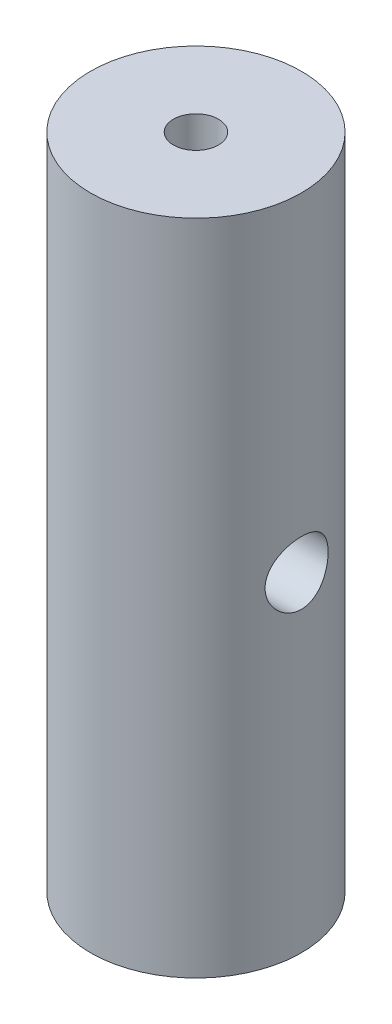
ISO-10303-21;
HEADER;
FILE_DESCRIPTION(('STEP AP214'),'2;1');
FILE_NAME('part.step','',(''),(''),'','','');
FILE_SCHEMA(('AUTOMOTIVE_DESIGN { 1 0 10303 214 1 1 1 1 }'));
ENDSEC;
DATA;
#1=APPLICATION_CONTEXT('core data for automotive mechanical design processes');
#2=APPLICATION_PROTOCOL_DEFINITION('international standard','automotive_design',2000,#1);
#3=PRODUCT_CONTEXT('',#1,'mechanical');
#4=PRODUCT('Part','Part','',(#3));
#5=PRODUCT_RELATED_PRODUCT_CATEGORY('part','',(#4));
#6=PRODUCT_DEFINITION_FORMATION('','',#4);
#7=PRODUCT_DEFINITION_CONTEXT('part definition',#1,'design');
#8=PRODUCT_DEFINITION('design','',#6,#7);
#9=PRODUCT_DEFINITION_SHAPE('','',#8);
#10=(LENGTH_UNIT() NAMED_UNIT(*) SI_UNIT(.MILLI.,.METRE.));
#11=(NAMED_UNIT(*) PLANE_ANGLE_UNIT() SI_UNIT($,.RADIAN.));
#12=(NAMED_UNIT(*) SI_UNIT($,.STERADIAN.) SOLID_ANGLE_UNIT());
#13=UNCERTAINTY_MEASURE_WITH_UNIT(LENGTH_MEASURE(1.E-05),#10,'distance_accuracy_value','');
#14=(GEOMETRIC_REPRESENTATION_CONTEXT(3) GLOBAL_UNCERTAINTY_ASSIGNED_CONTEXT((#13)) GLOBAL_UNIT_ASSIGNED_CONTEXT((#10,
#11,#12)) REPRESENTATION_CONTEXT('',''));
#15=CARTESIAN_POINT('',(0.,0.,0.));
#16=DIRECTION('',(0.,0.,1.));
#17=DIRECTION('',(1.,0.,0.));
#18=AXIS2_PLACEMENT_3D('',#15,#16,#17);
#19=CARTESIAN_POINT('',(0.,19.812,0.));
#20=DIRECTION('',(0.,-1.,0.));
#21=DIRECTION('',(0.,0.,-1.));
#22=AXIS2_PLACEMENT_3D('',#19,#20,#21);
#23=CYLINDRICAL_SURFACE('',#22,6.35);
#24=CARTESIAN_POINT('',(-6.05950725533851,0.,-1.89865));
#25=CARTESIAN_POINT('',(-6.05950836209902,-0.104056731084945,-1.8986486602891));
#26=CARTESIAN_POINT('',(-6.06221695254554,-0.20812672559677,-1.89006656275361));
#27=CARTESIAN_POINT('',(-6.07271572302677,-0.413225301729166,-1.85605262289029));
#28=CARTESIAN_POINT('',(-6.08050762689435,-0.514252839441015,-1.83061506456021));
#29=CARTESIAN_POINT('',(-6.10021334185413,-0.710267716434304,-1.76383019431639));
#30=CARTESIAN_POINT('',(-6.11212032811037,-0.805264750401846,-1.72250921229591));
#31=CARTESIAN_POINT('',(-6.13870536810647,-0.987001282200298,-1.62521684578365));
#32=CARTESIAN_POINT('',(-6.15338383058776,-1.07373955917544,-1.56924329983886));
#33=CARTESIAN_POINT('',(-6.18437543123224,-1.23922318381633,-1.442350823399));
#34=CARTESIAN_POINT('',(-6.20072321880337,-1.3176705434263,-1.37105165352194));
#35=CARTESIAN_POINT('',(-6.23291539727252,-1.46169206825804,-1.21634680114716));
#36=CARTESIAN_POINT('',(-6.248759723671,-1.52726458958394,-1.13293957502026));
#37=CARTESIAN_POINT('',(-6.27855311753239,-1.64496743410846,-0.954268086691941));
#38=CARTESIAN_POINT('',(-6.29245659931722,-1.69679416452574,-0.858795560945127));
#39=CARTESIAN_POINT('',(-6.31639934558556,-1.78354138284115,-0.660003889485409));
#40=CARTESIAN_POINT('',(-6.32643943753717,-1.81846549138823,-0.556686429697635));
#41=CARTESIAN_POINT('',(-6.34127899400443,-1.86943064283986,-0.34825498883519));
#42=CARTESIAN_POINT('',(-6.34621932545434,-1.88598027062312,-0.243275575871007));
#43=CARTESIAN_POINT('',(-6.35079868928174,-1.90133457696502,-0.0319216940235352));
#44=CARTESIAN_POINT('',(-6.3504388279676,-1.90014295865047,0.0744524791004591));
#45=CARTESIAN_POINT('',(-6.34455804021394,-1.88039050467709,0.28200920812676));
#46=CARTESIAN_POINT('',(-6.3392007582213,-1.86238038390201,0.383249540255709));
#47=CARTESIAN_POINT('',(-6.32412578388769,-1.81040145014144,0.58119894973728));
#48=CARTESIAN_POINT('',(-6.31440781612032,-1.7764316291148,0.67790774044585));
#49=CARTESIAN_POINT('',(-6.29147664295411,-1.6931231482956,0.865360995285923));
#50=CARTESIAN_POINT('',(-6.27822420569972,-1.64361080436898,0.956023273275862));
#51=CARTESIAN_POINT('',(-6.24963047038054,-1.53076001060854,1.12792903461921));
#52=CARTESIAN_POINT('',(-6.23428867970202,-1.46741829804835,1.20917028835806));
#53=CARTESIAN_POINT('',(-6.20246515386102,-1.32584846862672,1.36321447478767));
#54=CARTESIAN_POINT('',(-6.18596226363452,-1.24714309209676,1.43557501023548));
#55=CARTESIAN_POINT('',(-6.15419081446999,-1.07855363746694,1.56619480309855));
#56=CARTESIAN_POINT('',(-6.13892237660228,-0.988668465084916,1.62445267849385));
#57=CARTESIAN_POINT('',(-6.11124797523516,-0.799112673898009,1.72567072676681));
#58=CARTESIAN_POINT('',(-6.0988704872523,-0.699357451496821,1.76848081308384));
#59=CARTESIAN_POINT('',(-6.07871772039672,-0.493597626902782,1.83656363554426));
#60=CARTESIAN_POINT('',(-6.07094095204196,-0.387595059521354,1.86184204802071));
#61=CARTESIAN_POINT('',(-6.0611967498317,-0.176557719136448,1.89331907060701));
#62=CARTESIAN_POINT('',(-6.0590247902462,-0.0716325533841485,1.90018977282286));
#63=CARTESIAN_POINT('',(-6.06017075549361,0.137874285456838,1.89653240871972));
#64=CARTESIAN_POINT('',(-6.06348791795368,0.242456004224858,1.88600675854449));
#65=CARTESIAN_POINT('',(-6.07503772913528,0.445510781136036,1.84845383888855));
#66=CARTESIAN_POINT('',(-6.08314158629683,0.54407179567361,1.8218585265992));
#67=CARTESIAN_POINT('',(-6.1032184910947,0.735326194242806,1.75342161272866));
#68=CARTESIAN_POINT('',(-6.11519213339039,0.828018673852953,1.71157766780542));
#69=CARTESIAN_POINT('',(-6.14205682604908,1.00764071743193,1.61255368361553));
#70=CARTESIAN_POINT('',(-6.15701721855646,1.09435041082504,1.55499409715736));
#71=CARTESIAN_POINT('',(-6.18802036827941,1.25712578840839,1.42662408374765));
#72=CARTESIAN_POINT('',(-6.20406338223695,1.33318893454616,1.35581050652144));
#73=CARTESIAN_POINT('',(-6.23615132972717,1.47544712256741,1.1997844495878));
#74=CARTESIAN_POINT('',(-6.25217383048129,1.54116586941328,1.11413201460967));
#75=CARTESIAN_POINT('',(-6.28181001766366,1.65730851583797,0.932633457352187));
#76=CARTESIAN_POINT('',(-6.2954238242869,1.70773317868864,0.836787844099666));
#77=CARTESIAN_POINT('',(-6.31862529359599,1.79136991025286,0.638259815334184));
#78=CARTESIAN_POINT('',(-6.32824297220222,1.82471075873782,0.535635337960174));
#79=CARTESIAN_POINT('',(-6.34250107683316,1.87356479072753,0.325901228017517));
#80=CARTESIAN_POINT('',(-6.34714291652577,1.88908303783766,0.218792878336237));
#81=CARTESIAN_POINT('',(-6.35084087390088,1.90146836594257,0.00753454649049496));
#82=CARTESIAN_POINT('',(-6.35010393022823,1.89902640389055,-0.0965718108486248));
#83=CARTESIAN_POINT('',(-6.34361423906007,1.87721091003836,-0.302826535456635));
#84=CARTESIAN_POINT('',(-6.33786177271047,1.85783832728664,-0.404975012146831));
#85=CARTESIAN_POINT('',(-6.32204583525025,1.80313806615273,-0.603360373971998));
#86=CARTESIAN_POINT('',(-6.31202872896096,1.76798176905753,-0.699648463014059));
#87=CARTESIAN_POINT('',(-6.28871957901085,1.6828652584623,-0.885009886335531));
#88=CARTESIAN_POINT('',(-6.27542699926727,1.63290262140026,-0.974082036438965));
#89=CARTESIAN_POINT('',(-6.24643795947491,1.51774683028589,-1.14556553178506));
#90=CARTESIAN_POINT('',(-6.23067843411207,1.45211937566507,-1.22767448433797));
#91=CARTESIAN_POINT('',(-6.19873502651731,1.30828028025935,-1.37994531768062));
#92=CARTESIAN_POINT('',(-6.18255102354695,1.23006502578324,-1.45010375578932));
#93=CARTESIAN_POINT('',(-6.15102837350678,1.06049674556892,-1.57856319842188));
#94=CARTESIAN_POINT('',(-6.1357288343291,0.968823816704458,-1.63645259133346));
#95=CARTESIAN_POINT('',(-6.10833238034875,0.776605160437494,-1.73593009553797));
#96=CARTESIAN_POINT('',(-6.09623390901123,0.676063777194378,-1.77752613429883));
#97=CARTESIAN_POINT('',(-6.07782111879218,0.480322774737779,-1.83943365776697));
#98=CARTESIAN_POINT('',(-6.07101802449385,0.385746276493829,-1.8615788970489));
#99=CARTESIAN_POINT('',(-6.06186101519048,0.194116704322022,-1.89118624548325));
#100=CARTESIAN_POINT('',(-6.05950622295226,0.0970641225203689,-1.89865124968237));
#101=CARTESIAN_POINT('',(-6.05950725533851,0.,-1.89865));
#102=B_SPLINE_CURVE_WITH_KNOTS('',3,(#24,#25,#26,#27,#28,#29,#30,#31,#32,#33,#34,#35,#36,#37,
#38,#39,#40,#41,#42,#43,#44,#45,#46,#47,#48,#49,#50,#51,#52,#53,#54,#55,#56,#57,#58,#59,#60,#61,
#62,#63,#64,#65,#66,#67,#68,#69,#70,#71,#72,#73,#74,#75,#76,#77,#78,#79,#80,#81,#82,#83,#84,#85,
#86,#87,#88,#89,#90,#91,#92,#93,#94,#95,#96,#97,#98,#99,#100,#101),.UNSPECIFIED.,.T.,.F.,(4,2,2,
2,2,2,2,2,2,2,2,2,2,2,2,2,2,2,2,2,2,2,2,2,2,2,2,2,2,2,2,2,2,2,2,2,2,2,4),(0.,0.31181217424738,
0.623730143993152,0.935133262915574,1.24658234395571,1.56690137708128,1.88726128289037,
2.21419791722968,2.54106448863615,2.85863887687209,3.17614697879781,3.48360985368429,
3.79109215104744,4.10214074924878,4.41326281177627,4.73630164641618,5.05937212512478,
5.3855019374521,5.71152610745593,6.02547325771771,6.3393768081665,6.64519621263726,
6.95106263390641,7.26509343820971,7.57919897792713,7.90506889573818,8.23092254789494,
8.55428234135175,8.87755024183972,9.18844844313185,9.49932921809684,9.80691312636898,
10.1145474090622,10.4319770816063,10.749498044586,11.0764009966181,11.4031446971402,
11.694060480974,11.984918888392),.UNSPECIFIED.);
#103=CARTESIAN_POINT('',(-6.05950725533851,0.,-1.89865));
#104=VERTEX_POINT('',#103);
#105=EDGE_CURVE('E403',#104,#104,#102,.T.);
#106=ORIENTED_EDGE('',*,*,#105,.F.);
#107=EDGE_LOOP('',(#106));
#108=FACE_BOUND('',#107,.T.);
#109=CARTESIAN_POINT('',(0.,19.812,0.));
#110=DIRECTION('',(0.,1.,0.));
#111=DIRECTION('',(0.,0.,1.));
#112=AXIS2_PLACEMENT_3D('',#109,#110,#111);
#113=CIRCLE('',#112,6.35);
#114=CARTESIAN_POINT('',(0.,19.812,6.35));
#115=VERTEX_POINT('',#114);
#116=EDGE_CURVE('E10',#115,#115,#113,.T.);
#117=ORIENTED_EDGE('',*,*,#116,.F.);
#118=EDGE_LOOP('',(#117));
#119=FACE_BOUND('',#118,.T.);
#120=CARTESIAN_POINT('',(0.,-19.812,0.));
#121=DIRECTION('',(0.,1.,0.));
#122=DIRECTION('',(0.,0.,1.));
#123=AXIS2_PLACEMENT_3D('',#120,#121,#122);
#124=CIRCLE('',#123,6.35);
#125=CARTESIAN_POINT('',(0.,-19.812,6.35));
#126=VERTEX_POINT('',#125);
#127=EDGE_CURVE('E368',#126,#126,#124,.T.);
#128=ORIENTED_EDGE('',*,*,#127,.T.);
#129=EDGE_LOOP('',(#128));
#130=FACE_BOUND('',#129,.T.);
#131=CARTESIAN_POINT('',(6.05950725533851,0.,1.89865));
#132=CARTESIAN_POINT('',(6.05950836209902,0.104056731084945,1.8986486602891));
#133=CARTESIAN_POINT('',(6.06221695254554,0.20812672559677,1.89006656275361));
#134=CARTESIAN_POINT('',(6.07271572302677,0.413225301729166,1.85605262289029));
#135=CARTESIAN_POINT('',(6.08050762689435,0.514252839441015,1.83061506456021));
#136=CARTESIAN_POINT('',(6.10021334185413,0.710267716434304,1.76383019431639));
#137=CARTESIAN_POINT('',(6.11212032811037,0.805264750401846,1.72250921229591));
#138=CARTESIAN_POINT('',(6.13870536810647,0.987001282200298,1.62521684578365));
#139=CARTESIAN_POINT('',(6.15338383058776,1.07373955917544,1.56924329983886));
#140=CARTESIAN_POINT('',(6.18437543123224,1.23922318381633,1.442350823399));
#141=CARTESIAN_POINT('',(6.20072321880337,1.3176705434263,1.37105165352194));
#142=CARTESIAN_POINT('',(6.23291539727252,1.46169206825804,1.21634680114716));
#143=CARTESIAN_POINT('',(6.248759723671,1.52726458958394,1.13293957502026));
#144=CARTESIAN_POINT('',(6.27855311753239,1.64496743410846,0.954268086691941));
#145=CARTESIAN_POINT('',(6.29245659931722,1.69679416452574,0.858795560945127));
#146=CARTESIAN_POINT('',(6.31639934558556,1.78354138284115,0.660003889485409));
#147=CARTESIAN_POINT('',(6.32643943753717,1.81846549138823,0.556686429697635));
#148=CARTESIAN_POINT('',(6.34127899400443,1.86943064283986,0.34825498883519));
#149=CARTESIAN_POINT('',(6.34621932545434,1.88598027062312,0.243275575871007));
#150=CARTESIAN_POINT('',(6.35079868928174,1.90133457696502,0.0319216940235352));
#151=CARTESIAN_POINT('',(6.3504388279676,1.90014295865047,-0.0744524791004591));
#152=CARTESIAN_POINT('',(6.34455804021394,1.88039050467709,-0.28200920812676));
#153=CARTESIAN_POINT('',(6.3392007582213,1.86238038390201,-0.383249540255709));
#154=CARTESIAN_POINT('',(6.32412578388769,1.81040145014144,-0.58119894973728));
#155=CARTESIAN_POINT('',(6.31440781612032,1.7764316291148,-0.67790774044585));
#156=CARTESIAN_POINT('',(6.29147664295411,1.6931231482956,-0.865360995285923));
#157=CARTESIAN_POINT('',(6.27822420569972,1.64361080436898,-0.956023273275862));
#158=CARTESIAN_POINT('',(6.24963047038054,1.53076001060854,-1.12792903461921));
#159=CARTESIAN_POINT('',(6.23428867970202,1.46741829804835,-1.20917028835806));
#160=CARTESIAN_POINT('',(6.20246515386102,1.32584846862672,-1.36321447478767));
#161=CARTESIAN_POINT('',(6.18596226363452,1.24714309209676,-1.43557501023548));
#162=CARTESIAN_POINT('',(6.15419081446999,1.07855363746694,-1.56619480309855));
#163=CARTESIAN_POINT('',(6.13892237660228,0.988668465084916,-1.62445267849385));
#164=CARTESIAN_POINT('',(6.11124797523516,0.799112673898009,-1.72567072676681));
#165=CARTESIAN_POINT('',(6.0988704872523,0.699357451496821,-1.76848081308384));
#166=CARTESIAN_POINT('',(6.07871772039672,0.493597626902782,-1.83656363554426));
#167=CARTESIAN_POINT('',(6.07094095204196,0.387595059521354,-1.86184204802071));
#168=CARTESIAN_POINT('',(6.0611967498317,0.176557719136448,-1.89331907060701));
#169=CARTESIAN_POINT('',(6.0590247902462,0.0716325533841485,-1.90018977282286));
#170=CARTESIAN_POINT('',(6.06017075549361,-0.137874285456838,-1.89653240871972));
#171=CARTESIAN_POINT('',(6.06348791795368,-0.242456004224858,-1.88600675854449));
#172=CARTESIAN_POINT('',(6.07503772913528,-0.445510781136036,-1.84845383888855));
#173=CARTESIAN_POINT('',(6.08314158629683,-0.54407179567361,-1.8218585265992));
#174=CARTESIAN_POINT('',(6.1032184910947,-0.735326194242806,-1.75342161272866));
#175=CARTESIAN_POINT('',(6.11519213339039,-0.828018673852953,-1.71157766780542));
#176=CARTESIAN_POINT('',(6.14205682604908,-1.00764071743193,-1.61255368361553));
#177=CARTESIAN_POINT('',(6.15701721855646,-1.09435041082504,-1.55499409715736));
#178=CARTESIAN_POINT('',(6.18802036827941,-1.25712578840839,-1.42662408374765));
#179=CARTESIAN_POINT('',(6.20406338223695,-1.33318893454616,-1.35581050652144));
#180=CARTESIAN_POINT('',(6.23615132972717,-1.47544712256741,-1.1997844495878));
#181=CARTESIAN_POINT('',(6.25217383048129,-1.54116586941328,-1.11413201460967));
#182=CARTESIAN_POINT('',(6.28181001766366,-1.65730851583797,-0.932633457352187));
#183=CARTESIAN_POINT('',(6.2954238242869,-1.70773317868864,-0.836787844099666));
#184=CARTESIAN_POINT('',(6.31862529359599,-1.79136991025286,-0.638259815334184));
#185=CARTESIAN_POINT('',(6.32824297220222,-1.82471075873782,-0.535635337960174));
#186=CARTESIAN_POINT('',(6.34250107683316,-1.87356479072753,-0.325901228017517));
#187=CARTESIAN_POINT('',(6.34714291652577,-1.88908303783766,-0.218792878336237));
#188=CARTESIAN_POINT('',(6.35084087390088,-1.90146836594257,-0.00753454649049496));
#189=CARTESIAN_POINT('',(6.35010393022823,-1.89902640389055,0.0965718108486248));
#190=CARTESIAN_POINT('',(6.34361423906007,-1.87721091003836,0.302826535456635));
#191=CARTESIAN_POINT('',(6.33786177271047,-1.85783832728664,0.404975012146831));
#192=CARTESIAN_POINT('',(6.32204583525025,-1.80313806615273,0.603360373971998));
#193=CARTESIAN_POINT('',(6.31202872896096,-1.76798176905753,0.699648463014059));
#194=CARTESIAN_POINT('',(6.28871957901085,-1.6828652584623,0.885009886335531));
#195=CARTESIAN_POINT('',(6.27542699926727,-1.63290262140026,0.974082036438965));
#196=CARTESIAN_POINT('',(6.24643795947491,-1.51774683028589,1.14556553178506));
#197=CARTESIAN_POINT('',(6.23067843411207,-1.45211937566507,1.22767448433797));
#198=CARTESIAN_POINT('',(6.19873502651731,-1.30828028025935,1.37994531768062));
#199=CARTESIAN_POINT('',(6.18255102354695,-1.23006502578324,1.45010375578932));
#200=CARTESIAN_POINT('',(6.15102837350678,-1.06049674556892,1.57856319842188));
#201=CARTESIAN_POINT('',(6.1357288343291,-0.968823816704458,1.63645259133346));
#202=CARTESIAN_POINT('',(6.10833238034875,-0.776605160437494,1.73593009553797));
#203=CARTESIAN_POINT('',(6.09623390901123,-0.676063777194378,1.77752613429883));
#204=CARTESIAN_POINT('',(6.07782111879218,-0.480322774737779,1.83943365776697));
#205=CARTESIAN_POINT('',(6.07101802449385,-0.385746276493829,1.8615788970489));
#206=CARTESIAN_POINT('',(6.06186101519048,-0.194116704322022,1.89118624548325));
#207=CARTESIAN_POINT('',(6.05950622295226,-0.0970641225203689,1.89865124968237));
#208=CARTESIAN_POINT('',(6.05950725533851,0.,1.89865));
#209=B_SPLINE_CURVE_WITH_KNOTS('',3,(#131,#132,#133,#134,#135,#136,#137,#138,#139,#140,#141,
#142,#143,#144,#145,#146,#147,#148,#149,#150,#151,#152,#153,#154,#155,#156,#157,#158,#159,#160,
#161,#162,#163,#164,#165,#166,#167,#168,#169,#170,#171,#172,#173,#174,#175,#176,#177,#178,#179,
#180,#181,#182,#183,#184,#185,#186,#187,#188,#189,#190,#191,#192,#193,#194,#195,#196,#197,#198,
#199,#200,#201,#202,#203,#204,#205,#206,#207,#208),.UNSPECIFIED.,.T.,.F.,(4,2,2,2,2,2,2,2,2,2,2,
2,2,2,2,2,2,2,2,2,2,2,2,2,2,2,2,2,2,2,2,2,2,2,2,2,2,2,4),(0.,0.31181217424738,0.623730143993152,
0.935133262915574,1.24658234395571,1.56690137708128,1.88726128289037,2.21419791722968,
2.54106448863615,2.85863887687209,3.17614697879781,3.48360985368429,3.79109215104744,
4.10214074924878,4.41326281177627,4.73630164641618,5.05937212512478,5.3855019374521,
5.71152610745593,6.02547325771771,6.3393768081665,6.64519621263726,6.95106263390641,
7.26509343820971,7.57919897792713,7.90506889573818,8.23092254789494,8.55428234135175,
8.87755024183972,9.18844844313185,9.49932921809684,9.80691312636898,10.1145474090622,
10.4319770816063,10.749498044586,11.0764009966181,11.4031446971402,11.694060480974,
11.984918888392),.UNSPECIFIED.);
#210=CARTESIAN_POINT('',(6.05950725533851,0.,1.89865));
#211=VERTEX_POINT('',#210);
#212=EDGE_CURVE('E377',#211,#211,#209,.T.);
#213=ORIENTED_EDGE('',*,*,#212,.T.);
#214=EDGE_LOOP('',(#213));
#215=FACE_BOUND('',#214,.T.);
#216=ADVANCED_FACE('F358',(#108,#119,#130,#215),#23,.T.);
#217=CARTESIAN_POINT('',(0.,19.812,0.));
#218=DIRECTION('',(0.,-1.,0.));
#219=DIRECTION('',(0.,0.,-1.));
#220=AXIS2_PLACEMENT_3D('',#217,#218,#219);
#221=CYLINDRICAL_SURFACE('',#220,1.35255);
#222=CARTESIAN_POINT('',(0.,19.812,0.));
#223=DIRECTION('',(0.,1.,0.));
#224=DIRECTION('',(0.,0.,1.));
#225=AXIS2_PLACEMENT_3D('',#222,#223,#224);
#226=CIRCLE('',#225,1.35255);
#227=CARTESIAN_POINT('',(0.,19.812,1.35255));
#228=VERTEX_POINT('',#227);
#229=EDGE_CURVE('E364',#228,#228,#226,.T.);
#230=ORIENTED_EDGE('',*,*,#229,.T.);
#231=EDGE_LOOP('',(#230));
#232=FACE_BOUND('',#231,.T.);
#233=CARTESIAN_POINT('',(0.,1.33247150813817,1.35255));
#234=CARTESIAN_POINT('',(0.0644573003163354,1.33248593649608,1.3525424209944));
#235=CARTESIAN_POINT('',(0.128980714094125,1.33725119411588,1.34789163052537));
#236=CARTESIAN_POINT('',(0.255585997337747,1.35529640935822,1.32973317555473));
#237=CARTESIAN_POINT('',(0.317660947482036,1.36859888561776,1.31620208532972));
#238=CARTESIAN_POINT('',(0.43704350544646,1.40114837692001,1.28148681354834));
#239=CARTESIAN_POINT('',(0.494398576550309,1.42032367446222,1.26039446547653));
#240=CARTESIAN_POINT('',(0.604607744530873,1.46233762605462,1.21139660912624));
#241=CARTESIAN_POINT('',(0.657461693551215,1.48517640037455,1.18349087715274));
#242=CARTESIAN_POINT('',(0.767753972045849,1.53692436859108,1.1157360338652));
#243=CARTESIAN_POINT('',(0.824261464567261,1.56617963990043,1.07463584818554));
#244=CARTESIAN_POINT('',(0.930413586155368,1.62455786512243,0.984169990713068));
#245=CARTESIAN_POINT('',(0.980049328740303,1.65368060145796,0.934793795450094));
#246=CARTESIAN_POINT('',(1.07972394558052,1.71448602908551,0.818788703759585));
#247=CARTESIAN_POINT('',(1.12830841737045,1.74572264390881,0.75065274292682));
#248=CARTESIAN_POINT('',(1.21284906096366,1.80152130068311,0.604540169514396));
#249=CARTESIAN_POINT('',(1.24883143529742,1.82609716742564,0.52658443912835));
#250=CARTESIAN_POINT('',(1.29788150262974,1.86004332185196,0.385768728505541));
#251=CARTESIAN_POINT('',(1.31453570773605,1.87173989298873,0.324709039310266));
#252=CARTESIAN_POINT('',(1.3391787963776,1.88912728799049,0.200043623187486));
#253=CARTESIAN_POINT('',(1.34717478279326,1.8948230346048,0.136440027676018));
#254=CARTESIAN_POINT('',(1.3540472983365,1.89971541056279,0.00835395795508377));
#255=CARTESIAN_POINT('',(1.35290471206978,1.89889841704744,-0.0561300766768349));
#256=CARTESIAN_POINT('',(1.34152661689519,1.89080888917967,-0.183882057633612));
#257=CARTESIAN_POINT('',(1.33128862170788,1.883534589688,-0.247149666610384));
#258=CARTESIAN_POINT('',(1.30268040769067,1.86342604662003,-0.369109661531266));
#259=CARTESIAN_POINT('',(1.28452465030454,1.85073860811838,-0.427877643130363));
#260=CARTESIAN_POINT('',(1.24096352213167,1.82077494751975,-0.541387801661099));
#261=CARTESIAN_POINT('',(1.21555676378196,1.80349784718166,-0.59612920553634));
#262=CARTESIAN_POINT('',(1.15516345817008,1.76332560331707,-0.706674072205508));
#263=CARTESIAN_POINT('',(1.11942414491803,1.74001862359788,-0.761914019342255));
#264=CARTESIAN_POINT('',(1.04105699828861,1.69066644648906,-0.865933409958807));
#265=CARTESIAN_POINT('',(0.998422020444032,1.66461841903773,-0.914706056372636));
#266=CARTESIAN_POINT('',(0.898606932401428,1.60655718038407,-1.01376195369971));
#267=CARTESIAN_POINT('',(0.840193540722482,1.57432689129089,-1.06267812142212));
#268=CARTESIAN_POINT('',(0.715400318995639,1.5114134633479,-1.15039525140989));
#269=CARTESIAN_POINT('',(0.649020319236965,1.48073035747715,-1.18919599813293));
#270=CARTESIAN_POINT('',(0.524597915608785,1.43115674381104,-1.24811689948816));
#271=CARTESIAN_POINT('',(0.468058308058778,1.41116796046384,-1.27047690427161));
#272=CARTESIAN_POINT('',(0.350996476526585,1.37680116552478,-1.30764555228917));
#273=CARTESIAN_POINT('',(0.290486815827299,1.36240636616813,-1.32247683120387));
#274=CARTESIAN_POINT('',(0.191207756948063,1.34561411515082,-1.33950528089551));
#275=CARTESIAN_POINT('',(0.153304863712911,1.34072335427484,-1.34437932364351));
#276=CARTESIAN_POINT('',(0.0769425131122887,1.33414769683641,-1.35090399274471));
#277=CARTESIAN_POINT('',(0.0384830395163193,1.33246289395382,-1.35255452490518));
#278=CARTESIAN_POINT('',(-0.0644573003163353,1.33248593649608,-1.3525424209944));
#279=CARTESIAN_POINT('',(-0.128980714094125,1.33725119411588,-1.34789163052537));
#280=CARTESIAN_POINT('',(-0.255585997337747,1.35529640935822,-1.32973317555473));
#281=CARTESIAN_POINT('',(-0.317660947482036,1.36859888561776,-1.31620208532972));
#282=CARTESIAN_POINT('',(-0.43704350544646,1.40114837692001,-1.28148681354834));
#283=CARTESIAN_POINT('',(-0.494398576550309,1.42032367446222,-1.26039446547653));
#284=CARTESIAN_POINT('',(-0.604607744530873,1.46233762605462,-1.21139660912624));
#285=CARTESIAN_POINT('',(-0.657461693551215,1.48517640037455,-1.18349087715274));
#286=CARTESIAN_POINT('',(-0.767753972045849,1.53692436859108,-1.1157360338652));
#287=CARTESIAN_POINT('',(-0.82426146456726,1.56617963990043,-1.07463584818554));
#288=CARTESIAN_POINT('',(-0.930413586155368,1.62455786512243,-0.984169990713069));
#289=CARTESIAN_POINT('',(-0.980049328740303,1.65368060145796,-0.934793795450095));
#290=CARTESIAN_POINT('',(-1.07972394558052,1.71448602908551,-0.818788703759586));
#291=CARTESIAN_POINT('',(-1.12830841737045,1.74572264390881,-0.75065274292682));
#292=CARTESIAN_POINT('',(-1.21284906096366,1.80152130068311,-0.604540169514396));
#293=CARTESIAN_POINT('',(-1.24883143529742,1.82609716742564,-0.526584439128351));
#294=CARTESIAN_POINT('',(-1.29788150262974,1.86004332185196,-0.385768728505541));
#295=CARTESIAN_POINT('',(-1.31453570773605,1.87173989298873,-0.324709039310266));
#296=CARTESIAN_POINT('',(-1.3391787963776,1.88912728799049,-0.200043623187486));
#297=CARTESIAN_POINT('',(-1.34717478279326,1.8948230346048,-0.136440027676018));
#298=CARTESIAN_POINT('',(-1.3540472983365,1.89971541056279,-0.00835395795508389));
#299=CARTESIAN_POINT('',(-1.35290471206978,1.89889841704744,0.056130076676835));
#300=CARTESIAN_POINT('',(-1.34152661689519,1.89080888917967,0.183882057633612));
#301=CARTESIAN_POINT('',(-1.33128862170788,1.883534589688,0.247149666610384));
#302=CARTESIAN_POINT('',(-1.30268040769067,1.86342604662003,0.369109661531266));
#303=CARTESIAN_POINT('',(-1.28452465030454,1.85073860811838,0.427877643130362));
#304=CARTESIAN_POINT('',(-1.24096352213167,1.82077494751975,0.541387801661098));
#305=CARTESIAN_POINT('',(-1.21555676378196,1.80349784718166,0.596129205536339));
#306=CARTESIAN_POINT('',(-1.15516345817008,1.76332560331707,0.706674072205508));
#307=CARTESIAN_POINT('',(-1.11942414491803,1.74001862359788,0.761914019342255));
#308=CARTESIAN_POINT('',(-1.04105699828861,1.69066644648906,0.865933409958807));
#309=CARTESIAN_POINT('',(-0.998422020444032,1.66461841903773,0.914706056372636));
#310=CARTESIAN_POINT('',(-0.898606932401428,1.60655718038407,1.01376195369971));
#311=CARTESIAN_POINT('',(-0.840193540722482,1.57432689129089,1.06267812142212));
#312=CARTESIAN_POINT('',(-0.715400318995639,1.5114134633479,1.15039525140989));
#313=CARTESIAN_POINT('',(-0.649020319236965,1.48073035747715,1.18919599813293));
#314=CARTESIAN_POINT('',(-0.524597915608784,1.43115674381104,1.24811689948816));
#315=CARTESIAN_POINT('',(-0.468058308058777,1.41116796046384,1.27047690427161));
#316=CARTESIAN_POINT('',(-0.350996476526584,1.37680116552478,1.30764555228917));
#317=CARTESIAN_POINT('',(-0.290486815827299,1.36240636616813,1.32247683120387));
#318=CARTESIAN_POINT('',(-0.191207756948063,1.34561411515082,1.33950528089551));
#319=CARTESIAN_POINT('',(-0.153304863712911,1.34072335427484,1.34437932364351));
#320=CARTESIAN_POINT('',(-0.0769425131122892,1.33414769683641,1.35090399274471));
#321=CARTESIAN_POINT('',(-0.0384830395163196,1.33246289395382,1.35255452490518));
#322=CARTESIAN_POINT('',(0.,1.33247150813817,1.35255));
#323=B_SPLINE_CURVE_WITH_KNOTS('',3,(#233,#234,#235,#236,#237,#238,#239,#240,#241,#242,#243,
#244,#245,#246,#247,#248,#249,#250,#251,#252,#253,#254,#255,#256,#257,#258,#259,#260,#261,#262,
#263,#264,#265,#266,#267,#268,#269,#270,#271,#272,#273,#274,#275,#276,#277,#278,#279,#280,#281,
#282,#283,#284,#285,#286,#287,#288,#289,#290,#291,#292,#293,#294,#295,#296,#297,#298,#299,#300,
#301,#302,#303,#304,#305,#306,#307,#308,#309,#310,#311,#312,#313,#314,#315,#316,#317,#318,#319,
#320,#321,#322),.UNSPECIFIED.,.T.,.F.,(4,2,2,2,2,2,2,2,2,2,2,2,2,2,2,2,2,2,2,2,2,2,2,2,2,2,2,2,
2,2,2,2,2,2,2,2,2,2,2,2,2,2,2,2,4),(0.,0.193181949104333,0.386875560629897,0.578292263182397,
0.769715251116814,0.996165438148166,1.22290578629954,1.48939052429266,1.75531784580879,
1.94757999943116,2.13968430856258,2.3321905522853,2.52474943483294,2.71238844369699,
2.90006338356107,3.10868724247658,3.31752865381553,3.56471786886398,3.8119123506611,
4.00327891168893,4.19406665544621,4.30939899673494,4.42473470804673,4.61791665715106,
4.81161026867662,5.00302697122912,5.19444995916354,5.42090014619489,5.64764049434627,
5.91412523233938,6.18005255385551,6.37231470747789,6.56441901660931,6.75692526033203,
6.94948414287967,7.13712315174371,7.3247980916078,7.5334219505233,7.74226336186225,
7.98945257691071,8.23664705870782,8.42801361973566,8.61880136349293,8.73413370478167,
8.84946941609345),.UNSPECIFIED.);
#324=CARTESIAN_POINT('',(0.,1.33247150813817,1.35255));
#325=VERTEX_POINT('',#324);
#326=EDGE_CURVE('E398',#325,#325,#323,.T.);
#327=ORIENTED_EDGE('',*,*,#326,.F.);
#328=EDGE_LOOP('',(#327));
#329=FACE_BOUND('',#328,.T.);
#330=ADVANCED_FACE('F413',(#232,#329),#221,.F.);
#331=CARTESIAN_POINT('',(0.,-19.812,0.));
#332=DIRECTION('',(0.,1.,0.));
#333=DIRECTION('',(0.,0.,1.));
#334=AXIS2_PLACEMENT_3D('',#331,#332,#333);
#335=CIRCLE('',#334,1.35255);
#336=CARTESIAN_POINT('',(0.,-19.812,1.35255));
#337=VERTEX_POINT('',#336);
#338=EDGE_CURVE('E372',#337,#337,#335,.T.);
#339=ORIENTED_EDGE('',*,*,#338,.F.);
#340=EDGE_LOOP('',(#339));
#341=FACE_BOUND('',#340,.T.);
#342=CARTESIAN_POINT('',(0.,-1.33247150813817,-1.35255));
#343=CARTESIAN_POINT('',(0.0644573003163354,-1.33248593649608,-1.3525424209944));
#344=CARTESIAN_POINT('',(0.128980714094125,-1.33725119411588,-1.34789163052537));
#345=CARTESIAN_POINT('',(0.255585997337747,-1.35529640935822,-1.32973317555473));
#346=CARTESIAN_POINT('',(0.317660947482036,-1.36859888561776,-1.31620208532972));
#347=CARTESIAN_POINT('',(0.43704350544646,-1.40114837692001,-1.28148681354834));
#348=CARTESIAN_POINT('',(0.494398576550309,-1.42032367446222,-1.26039446547653));
#349=CARTESIAN_POINT('',(0.604607744530873,-1.46233762605462,-1.21139660912624));
#350=CARTESIAN_POINT('',(0.657461693551215,-1.48517640037455,-1.18349087715274));
#351=CARTESIAN_POINT('',(0.767753972045849,-1.53692436859108,-1.1157360338652));
#352=CARTESIAN_POINT('',(0.824261464567261,-1.56617963990043,-1.07463584818554));
#353=CARTESIAN_POINT('',(0.930413586155368,-1.62455786512243,-0.984169990713068));
#354=CARTESIAN_POINT('',(0.980049328740303,-1.65368060145796,-0.934793795450094));
#355=CARTESIAN_POINT('',(1.07972394558052,-1.71448602908551,-0.818788703759585));
#356=CARTESIAN_POINT('',(1.12830841737045,-1.74572264390881,-0.75065274292682));
#357=CARTESIAN_POINT('',(1.21284906096366,-1.80152130068311,-0.604540169514396));
#358=CARTESIAN_POINT('',(1.24883143529742,-1.82609716742564,-0.52658443912835));
#359=CARTESIAN_POINT('',(1.29788150262974,-1.86004332185196,-0.385768728505541));
#360=CARTESIAN_POINT('',(1.31453570773605,-1.87173989298873,-0.324709039310266));
#361=CARTESIAN_POINT('',(1.3391787963776,-1.88912728799049,-0.200043623187486));
#362=CARTESIAN_POINT('',(1.34717478279326,-1.8948230346048,-0.136440027676018));
#363=CARTESIAN_POINT('',(1.3540472983365,-1.89971541056279,-0.00835395795508377));
#364=CARTESIAN_POINT('',(1.35290471206978,-1.89889841704744,0.0561300766768349));
#365=CARTESIAN_POINT('',(1.34152661689519,-1.89080888917967,0.183882057633612));
#366=CARTESIAN_POINT('',(1.33128862170788,-1.883534589688,0.247149666610384));
#367=CARTESIAN_POINT('',(1.30268040769067,-1.86342604662003,0.369109661531266));
#368=CARTESIAN_POINT('',(1.28452465030454,-1.85073860811838,0.427877643130363));
#369=CARTESIAN_POINT('',(1.24096352213167,-1.82077494751975,0.541387801661099));
#370=CARTESIAN_POINT('',(1.21555676378196,-1.80349784718166,0.59612920553634));
#371=CARTESIAN_POINT('',(1.15516345817008,-1.76332560331707,0.706674072205508));
#372=CARTESIAN_POINT('',(1.11942414491803,-1.74001862359788,0.761914019342255));
#373=CARTESIAN_POINT('',(1.04105699828861,-1.69066644648906,0.865933409958807));
#374=CARTESIAN_POINT('',(0.998422020444032,-1.66461841903773,0.914706056372636));
#375=CARTESIAN_POINT('',(0.898606932401428,-1.60655718038407,1.01376195369971));
#376=CARTESIAN_POINT('',(0.840193540722482,-1.57432689129089,1.06267812142212));
#377=CARTESIAN_POINT('',(0.715400318995639,-1.5114134633479,1.15039525140989));
#378=CARTESIAN_POINT('',(0.649020319236965,-1.48073035747715,1.18919599813293));
#379=CARTESIAN_POINT('',(0.524597915608785,-1.43115674381104,1.24811689948816));
#380=CARTESIAN_POINT('',(0.468058308058778,-1.41116796046384,1.27047690427161));
#381=CARTESIAN_POINT('',(0.350996476526585,-1.37680116552478,1.30764555228917));
#382=CARTESIAN_POINT('',(0.290486815827299,-1.36240636616813,1.32247683120387));
#383=CARTESIAN_POINT('',(0.191207756948063,-1.34561411515082,1.33950528089551));
#384=CARTESIAN_POINT('',(0.153304863712911,-1.34072335427484,1.34437932364351));
#385=CARTESIAN_POINT('',(0.0769425131122887,-1.33414769683641,1.35090399274471));
#386=CARTESIAN_POINT('',(0.0384830395163193,-1.33246289395382,1.35255452490518));
#387=CARTESIAN_POINT('',(-0.0644573003163353,-1.33248593649608,1.3525424209944));
#388=CARTESIAN_POINT('',(-0.128980714094125,-1.33725119411588,1.34789163052537));
#389=CARTESIAN_POINT('',(-0.255585997337747,-1.35529640935822,1.32973317555473));
#390=CARTESIAN_POINT('',(-0.317660947482036,-1.36859888561776,1.31620208532972));
#391=CARTESIAN_POINT('',(-0.43704350544646,-1.40114837692001,1.28148681354834));
#392=CARTESIAN_POINT('',(-0.494398576550309,-1.42032367446222,1.26039446547653));
#393=CARTESIAN_POINT('',(-0.604607744530873,-1.46233762605462,1.21139660912624));
#394=CARTESIAN_POINT('',(-0.657461693551215,-1.48517640037455,1.18349087715274));
#395=CARTESIAN_POINT('',(-0.767753972045849,-1.53692436859108,1.1157360338652));
#396=CARTESIAN_POINT('',(-0.82426146456726,-1.56617963990043,1.07463584818554));
#397=CARTESIAN_POINT('',(-0.930413586155368,-1.62455786512243,0.984169990713069));
#398=CARTESIAN_POINT('',(-0.980049328740303,-1.65368060145796,0.934793795450095));
#399=CARTESIAN_POINT('',(-1.07972394558052,-1.71448602908551,0.818788703759586));
#400=CARTESIAN_POINT('',(-1.12830841737045,-1.74572264390881,0.75065274292682));
#401=CARTESIAN_POINT('',(-1.21284906096366,-1.80152130068311,0.604540169514396));
#402=CARTESIAN_POINT('',(-1.24883143529742,-1.82609716742564,0.526584439128351));
#403=CARTESIAN_POINT('',(-1.29788150262974,-1.86004332185196,0.385768728505541));
#404=CARTESIAN_POINT('',(-1.31453570773605,-1.87173989298873,0.324709039310266));
#405=CARTESIAN_POINT('',(-1.3391787963776,-1.88912728799049,0.200043623187486));
#406=CARTESIAN_POINT('',(-1.34717478279326,-1.8948230346048,0.136440027676018));
#407=CARTESIAN_POINT('',(-1.3540472983365,-1.89971541056279,0.00835395795508389));
#408=CARTESIAN_POINT('',(-1.35290471206978,-1.89889841704744,-0.056130076676835));
#409=CARTESIAN_POINT('',(-1.34152661689519,-1.89080888917967,-0.183882057633612));
#410=CARTESIAN_POINT('',(-1.33128862170788,-1.883534589688,-0.247149666610384));
#411=CARTESIAN_POINT('',(-1.30268040769067,-1.86342604662003,-0.369109661531266));
#412=CARTESIAN_POINT('',(-1.28452465030454,-1.85073860811838,-0.427877643130362));
#413=CARTESIAN_POINT('',(-1.24096352213167,-1.82077494751975,-0.541387801661098));
#414=CARTESIAN_POINT('',(-1.21555676378196,-1.80349784718166,-0.596129205536339));
#415=CARTESIAN_POINT('',(-1.15516345817008,-1.76332560331707,-0.706674072205508));
#416=CARTESIAN_POINT('',(-1.11942414491803,-1.74001862359788,-0.761914019342255));
#417=CARTESIAN_POINT('',(-1.04105699828861,-1.69066644648906,-0.865933409958807));
#418=CARTESIAN_POINT('',(-0.998422020444032,-1.66461841903773,-0.914706056372636));
#419=CARTESIAN_POINT('',(-0.898606932401428,-1.60655718038407,-1.01376195369971));
#420=CARTESIAN_POINT('',(-0.840193540722482,-1.57432689129089,-1.06267812142212));
#421=CARTESIAN_POINT('',(-0.715400318995639,-1.5114134633479,-1.15039525140989));
#422=CARTESIAN_POINT('',(-0.649020319236965,-1.48073035747715,-1.18919599813293));
#423=CARTESIAN_POINT('',(-0.524597915608784,-1.43115674381104,-1.24811689948816));
#424=CARTESIAN_POINT('',(-0.468058308058777,-1.41116796046384,-1.27047690427161));
#425=CARTESIAN_POINT('',(-0.350996476526584,-1.37680116552478,-1.30764555228917));
#426=CARTESIAN_POINT('',(-0.290486815827299,-1.36240636616813,-1.32247683120387));
#427=CARTESIAN_POINT('',(-0.191207756948063,-1.34561411515082,-1.33950528089551));
#428=CARTESIAN_POINT('',(-0.153304863712911,-1.34072335427484,-1.34437932364351));
#429=CARTESIAN_POINT('',(-0.0769425131122892,-1.33414769683641,-1.35090399274471));
#430=CARTESIAN_POINT('',(-0.0384830395163196,-1.33246289395382,-1.35255452490518));
#431=CARTESIAN_POINT('',(0.,-1.33247150813817,-1.35255));
#432=B_SPLINE_CURVE_WITH_KNOTS('',3,(#342,#343,#344,#345,#346,#347,#348,#349,#350,#351,#352,
#353,#354,#355,#356,#357,#358,#359,#360,#361,#362,#363,#364,#365,#366,#367,#368,#369,#370,#371,
#372,#373,#374,#375,#376,#377,#378,#379,#380,#381,#382,#383,#384,#385,#386,#387,#388,#389,#390,
#391,#392,#393,#394,#395,#396,#397,#398,#399,#400,#401,#402,#403,#404,#405,#406,#407,#408,#409,
#410,#411,#412,#413,#414,#415,#416,#417,#418,#419,#420,#421,#422,#423,#424,#425,#426,#427,#428,
#429,#430,#431),.UNSPECIFIED.,.T.,.F.,(4,2,2,2,2,2,2,2,2,2,2,2,2,2,2,2,2,2,2,2,2,2,2,2,2,2,2,2,
2,2,2,2,2,2,2,2,2,2,2,2,2,2,2,2,4),(0.,0.193181949104333,0.386875560629897,0.578292263182397,
0.769715251116814,0.996165438148166,1.22290578629954,1.48939052429266,1.75531784580879,
1.94757999943116,2.13968430856258,2.3321905522853,2.52474943483294,2.71238844369699,
2.90006338356107,3.10868724247658,3.31752865381553,3.56471786886398,3.8119123506611,
4.00327891168893,4.19406665544621,4.30939899673494,4.42473470804673,4.61791665715106,
4.81161026867662,5.00302697122912,5.19444995916354,5.42090014619489,5.64764049434627,
5.91412523233938,6.18005255385551,6.37231470747789,6.56441901660931,6.75692526033203,
6.94948414287967,7.13712315174371,7.3247980916078,7.5334219505233,7.74226336186225,
7.98945257691071,8.23664705870782,8.42801361973566,8.61880136349293,8.73413370478167,
8.84946941609345),.UNSPECIFIED.);
#433=CARTESIAN_POINT('',(0.,-1.33247150813817,-1.35255));
#434=VERTEX_POINT('',#433);
#435=EDGE_CURVE('E384',#434,#434,#432,.T.);
#436=ORIENTED_EDGE('',*,*,#435,.F.);
#437=EDGE_LOOP('',(#436));
#438=FACE_BOUND('',#437,.T.);
#439=ADVANCED_FACE('F434',(#341,#438),#221,.F.);
#440=CARTESIAN_POINT('',(0.,19.812,0.));
#441=DIRECTION('',(0.,1.,0.));
#442=DIRECTION('',(0.,0.,1.));
#443=AXIS2_PLACEMENT_3D('',#440,#441,#442);
#444=PLANE('',#443);
#445=ORIENTED_EDGE('',*,*,#116,.T.);
#446=EDGE_LOOP('',(#445));
#447=FACE_BOUND('',#446,.T.);
#448=ORIENTED_EDGE('',*,*,#229,.F.);
#449=EDGE_LOOP('',(#448));
#450=FACE_BOUND('',#449,.T.);
#451=ADVANCED_FACE('F426',(#447,#450),#444,.T.);
#452=CARTESIAN_POINT('',(0.,-19.812,0.));
#453=DIRECTION('',(0.,1.,0.));
#454=DIRECTION('',(0.,0.,1.));
#455=AXIS2_PLACEMENT_3D('',#452,#453,#454);
#456=PLANE('',#455);
#457=ORIENTED_EDGE('',*,*,#338,.T.);
#458=EDGE_LOOP('',(#457));
#459=FACE_BOUND('',#458,.T.);
#460=ORIENTED_EDGE('',*,*,#127,.F.);
#461=EDGE_LOOP('',(#460));
#462=FACE_BOUND('',#461,.T.);
#463=ADVANCED_FACE('F420',(#459,#462),#456,.F.);
#464=CARTESIAN_POINT('',(6.351,0.,0.));
#465=DIRECTION('',(-1.,0.,0.));
#466=DIRECTION('',(0.,0.,1.));
#467=AXIS2_PLACEMENT_3D('',#464,#465,#466);
#468=CYLINDRICAL_SURFACE('',#467,1.89865);
#469=ORIENTED_EDGE('',*,*,#435,.T.);
#470=EDGE_LOOP('',(#469));
#471=FACE_BOUND('',#470,.T.);
#472=ORIENTED_EDGE('',*,*,#326,.T.);
#473=EDGE_LOOP('',(#472));
#474=FACE_BOUND('',#473,.T.);
#475=ORIENTED_EDGE('',*,*,#212,.F.);
#476=EDGE_LOOP('',(#475));
#477=FACE_BOUND('',#476,.T.);
#478=ORIENTED_EDGE('',*,*,#105,.T.);
#479=EDGE_LOOP('',(#478));
#480=FACE_BOUND('',#479,.T.);
#481=ADVANCED_FACE('F389',(#471,#474,#477,#480),#468,.F.);
#482=CLOSED_SHELL('',(#216,#330,#439,#451,#463,#481));
#483=MANIFOLD_SOLID_BREP('B2',#482);
#484=ADVANCED_BREP_SHAPE_REPRESENTATION('',(#18,#483),#14);
#485=SHAPE_DEFINITION_REPRESENTATION(#9,#484);
ENDSEC;
END-ISO-10303-21;
